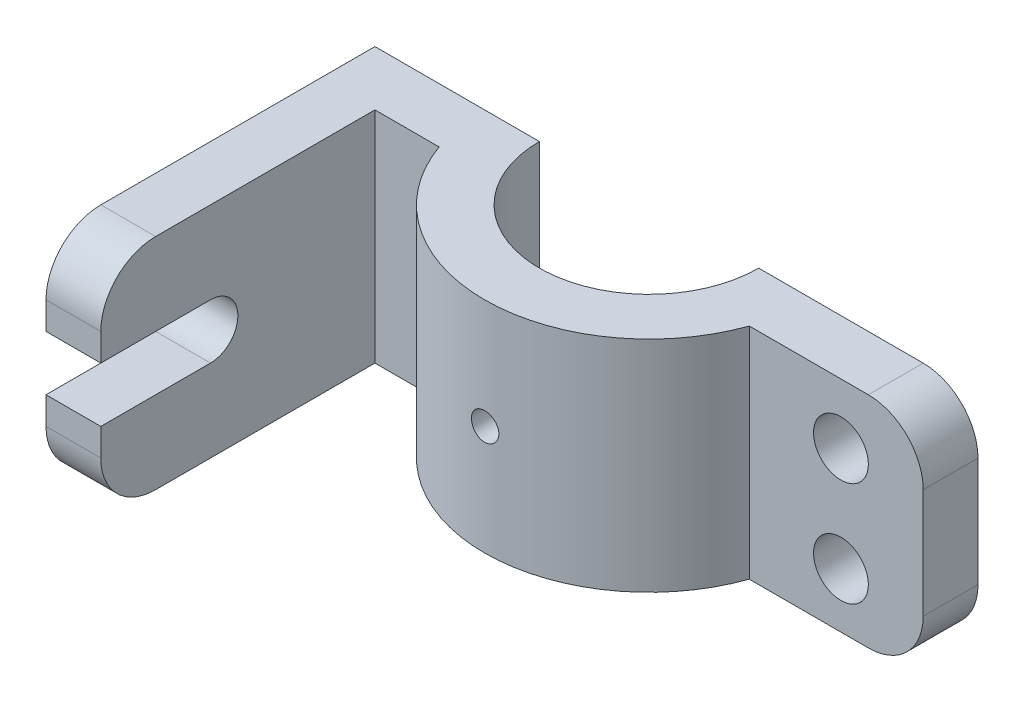
ISO-10303-21;
HEADER;
FILE_DESCRIPTION(('STEP AP214'),'2;1');
FILE_NAME('part.step','',(''),(''),'','','');
FILE_SCHEMA(('AUTOMOTIVE_DESIGN { 1 0 10303 214 1 1 1 1 }'));
ENDSEC;
DATA;
#1=APPLICATION_CONTEXT('core data for automotive mechanical design processes');
#2=APPLICATION_PROTOCOL_DEFINITION('international standard','automotive_design',2000,#1);
#3=PRODUCT_CONTEXT('',#1,'mechanical');
#4=PRODUCT('Part','Part','',(#3));
#5=PRODUCT_RELATED_PRODUCT_CATEGORY('part','',(#4));
#6=PRODUCT_DEFINITION_FORMATION('','',#4);
#7=PRODUCT_DEFINITION_CONTEXT('part definition',#1,'design');
#8=PRODUCT_DEFINITION('design','',#6,#7);
#9=PRODUCT_DEFINITION_SHAPE('','',#8);
#10=(LENGTH_UNIT() NAMED_UNIT(*) SI_UNIT(.MILLI.,.METRE.));
#11=(NAMED_UNIT(*) PLANE_ANGLE_UNIT() SI_UNIT($,.RADIAN.));
#12=(NAMED_UNIT(*) SI_UNIT($,.STERADIAN.) SOLID_ANGLE_UNIT());
#13=UNCERTAINTY_MEASURE_WITH_UNIT(LENGTH_MEASURE(1.E-05),#10,'distance_accuracy_value','');
#14=(GEOMETRIC_REPRESENTATION_CONTEXT(3) GLOBAL_UNCERTAINTY_ASSIGNED_CONTEXT((#13)) GLOBAL_UNIT_ASSIGNED_CONTEXT((#10,
#11,#12)) REPRESENTATION_CONTEXT('',''));
#15=CARTESIAN_POINT('',(0.,0.,0.));
#16=DIRECTION('',(0.,0.,1.));
#17=DIRECTION('',(1.,0.,0.));
#18=AXIS2_PLACEMENT_3D('',#15,#16,#17);
#19=CARTESIAN_POINT('',(-63.5,-25.4,76.2));
#20=DIRECTION('',(0.,0.,1.));
#21=DIRECTION('',(1.,0.,0.));
#22=AXIS2_PLACEMENT_3D('',#19,#20,#21);
#23=PLANE('',#22);
#24=DIRECTION('',(0.,1.,0.));
#25=VECTOR('',#24,1.);
#26=CARTESIAN_POINT('',(-50.8,-25.4,76.2));
#27=LINE('',#26,#25);
#28=CARTESIAN_POINT('',(-50.8,6.35,76.2));
#29=VERTEX_POINT('',#28);
#30=CARTESIAN_POINT('',(-50.8,12.7,76.2));
#31=VERTEX_POINT('',#30);
#32=EDGE_CURVE('E255',#29,#31,#27,.T.);
#33=ORIENTED_EDGE('',*,*,#32,.T.);
#34=DIRECTION('',(1.,0.,0.));
#35=VECTOR('',#34,1.);
#36=CARTESIAN_POINT('',(-63.5,12.7,76.2));
#37=LINE('',#36,#35);
#38=CARTESIAN_POINT('',(-63.5,12.7,76.2));
#39=VERTEX_POINT('',#38);
#40=EDGE_CURVE('E186',#39,#31,#37,.T.);
#41=ORIENTED_EDGE('',*,*,#40,.F.);
#42=DIRECTION('',(0.,1.,0.));
#43=VECTOR('',#42,1.);
#44=CARTESIAN_POINT('',(-63.5,-25.4,76.2));
#45=LINE('',#44,#43);
#46=CARTESIAN_POINT('',(-63.5,6.35,76.2));
#47=VERTEX_POINT('',#46);
#48=EDGE_CURVE('E195',#47,#39,#45,.T.);
#49=ORIENTED_EDGE('',*,*,#48,.F.);
#50=DIRECTION('',(1.,0.,0.));
#51=VECTOR('',#50,1.);
#52=CARTESIAN_POINT('',(-63.5,6.35,76.2));
#53=LINE('',#52,#51);
#54=EDGE_CURVE('E374',#47,#29,#53,.T.);
#55=ORIENTED_EDGE('',*,*,#54,.T.);
#56=EDGE_LOOP('',(#33,#41,#49,#55));
#57=FACE_BOUND('',#56,.T.);
#58=ADVANCED_FACE('F42',(#57),#23,.T.);
#59=CARTESIAN_POINT('',(0.,-25.4,0.));
#60=DIRECTION('',(0.,1.,0.));
#61=DIRECTION('',(0.,0.,1.));
#62=AXIS2_PLACEMENT_3D('',#59,#60,#61);
#63=CYLINDRICAL_SURFACE('',#62,38.1);
#64=DIRECTION('',(0.,1.,0.));
#65=VECTOR('',#64,1.);
#66=CARTESIAN_POINT('',(35.9210244842766,-25.4,12.7));
#67=LINE('',#66,#65);
#68=CARTESIAN_POINT('',(35.9210244842766,-25.4,12.7));
#69=VERTEX_POINT('',#68);
#70=CARTESIAN_POINT('',(35.9210244842766,25.4,12.7));
#71=VERTEX_POINT('',#70);
#72=EDGE_CURVE('E246',#69,#71,#67,.T.);
#73=ORIENTED_EDGE('',*,*,#72,.T.);
#74=CARTESIAN_POINT('',(0.,25.4,0.));
#75=DIRECTION('',(0.,1.,0.));
#76=DIRECTION('',(0.,0.,1.));
#77=AXIS2_PLACEMENT_3D('',#74,#75,#76);
#78=CIRCLE('',#77,38.1);
#79=CARTESIAN_POINT('',(-35.9210244842766,25.4,12.7));
#80=VERTEX_POINT('',#79);
#81=EDGE_CURVE('E301',#80,#71,#78,.T.);
#82=ORIENTED_EDGE('',*,*,#81,.F.);
#83=DIRECTION('',(0.,1.,0.));
#84=VECTOR('',#83,1.);
#85=CARTESIAN_POINT('',(-35.9210244842766,-25.4,12.7));
#86=LINE('',#85,#84);
#87=CARTESIAN_POINT('',(-35.9210244842766,-25.4,12.7));
#88=VERTEX_POINT('',#87);
#89=EDGE_CURVE('E247',#88,#80,#86,.T.);
#90=ORIENTED_EDGE('',*,*,#89,.F.);
#91=CARTESIAN_POINT('',(0.,-25.4,0.));
#92=DIRECTION('',(0.,1.,0.));
#93=DIRECTION('',(0.,0.,1.));
#94=AXIS2_PLACEMENT_3D('',#91,#92,#93);
#95=CIRCLE('',#94,38.1);
#96=EDGE_CURVE('E217',#88,#69,#95,.T.);
#97=ORIENTED_EDGE('',*,*,#96,.T.);
#98=EDGE_LOOP('',(#73,#82,#90,#97));
#99=FACE_BOUND('',#98,.T.);
#100=CARTESIAN_POINT('',(0.,3.175,38.1));
#101=CARTESIAN_POINT('',(0.178009835499824,3.17499222497656,38.0999982668156));
#102=CARTESIAN_POINT('',(0.356140852297216,3.15997917084993,38.0987391612528));
#103=CARTESIAN_POINT('',(0.707474361973737,3.10031018286013,38.0938373989219));
#104=CARTESIAN_POINT('',(0.880671039090106,3.05562066578194,38.0901920418313));
#105=CARTESIAN_POINT('',(1.21699662148278,2.93790003665526,38.0809297195638));
#106=CARTESIAN_POINT('',(1.38013116284815,2.86488496075133,38.0753138701269));
#107=CARTESIAN_POINT('',(1.69178996609604,2.69261452880642,38.0627403508946));
#108=CARTESIAN_POINT('',(1.84031734388611,2.59336478570891,38.0557829682081));
#109=CARTESIAN_POINT('',(2.11896324989075,2.37116916352596,38.0412872607681));
#110=CARTESIAN_POINT('',(2.24903941992131,2.2481702435042,38.0337476587488));
#111=CARTESIAN_POINT('',(2.48672709897856,1.98207980567646,38.0189479905006));
#112=CARTESIAN_POINT('',(2.59433762110453,1.83898740563917,38.0116879365635));
#113=CARTESIAN_POINT('',(2.78418265358898,1.53651547821058,37.9982556219944));
#114=CARTESIAN_POINT('',(2.86637994462115,1.3771125130962,37.9920849624679));
#115=CARTESIAN_POINT('',(3.00282747723196,1.04670766160975,37.9815447012327));
#116=CARTESIAN_POINT('',(3.05707821245192,0.875705980175053,37.9771750677113));
#117=CARTESIAN_POINT('',(3.13596981967396,0.527382130777261,37.9707423231057));
#118=CARTESIAN_POINT('',(3.16067968761253,0.350075690523488,37.968673838225));
#119=CARTESIAN_POINT('',(3.18000128544898,-0.00617919752653686,37.9670606012069));
#120=CARTESIAN_POINT('',(3.17461358021004,-0.185127614443684,37.9675158017056));
#121=CARTESIAN_POINT('',(3.13394999388214,-0.539113937995906,37.970893621232));
#122=CARTESIAN_POINT('',(3.09874909852083,-0.714160525817611,37.9738100497468));
#123=CARTESIAN_POINT('',(2.99957485359084,-1.05585217897263,37.9817720033273));
#124=CARTESIAN_POINT('',(2.93560122300979,-1.22249716223298,37.9868175491873));
#125=CARTESIAN_POINT('',(2.78061352738271,-1.54289412616296,37.9984763494426));
#126=CARTESIAN_POINT('',(2.68956581960409,-1.69662975884034,38.0050915522431));
#127=CARTESIAN_POINT('',(2.48303873442488,-1.98666525075288,38.0191424929282));
#128=CARTESIAN_POINT('',(2.36755886222657,-2.12296475678366,38.026578247429));
#129=CARTESIAN_POINT('',(2.1150249235687,-2.37469495621897,38.0414599980697));
#130=CARTESIAN_POINT('',(1.97790603081507,-2.49006062861037,38.0489059561083));
#131=CARTESIAN_POINT('',(1.68621251648031,-2.69614562175866,38.0629474918672));
#132=CARTESIAN_POINT('',(1.53163788323619,-2.78686492604804,38.0695430690193));
#133=CARTESIAN_POINT('',(1.20937843362543,-2.94107794647314,38.0811419544561));
#134=CARTESIAN_POINT('',(1.04169223274381,-3.00456878281814,38.0861450943038));
#135=CARTESIAN_POINT('',(0.697989044137172,-3.10247707053297,38.0939934528246));
#136=CARTESIAN_POINT('',(0.521972229386114,-3.13689512528046,38.0968387162821));
#137=CARTESIAN_POINT('',(0.167167878021496,-3.17559932583201,38.1000449879418));
#138=CARTESIAN_POINT('',(-0.0116097974407479,-3.1799752824894,38.1004134006211));
#139=CARTESIAN_POINT('',(-0.367356239197988,-3.15870634250827,38.0986442362237));
#140=CARTESIAN_POINT('',(-0.544325022350487,-3.13306172589646,38.0965066825224));
#141=CARTESIAN_POINT('',(-0.891174101013421,-3.05255403391295,38.0899707414619));
#142=CARTESIAN_POINT('',(-1.06106412481862,-2.99773258711805,38.0855755755031));
#143=CARTESIAN_POINT('',(-1.3892344741369,-2.86046993379206,38.0750181510671));
#144=CARTESIAN_POINT('',(-1.54751461604895,-2.77802829058427,38.0688558646519));
#145=CARTESIAN_POINT('',(-1.84838091810856,-2.58763976623807,38.0554365379978));
#146=CARTESIAN_POINT('',(-1.99092931290567,-2.47963338719642,38.0481769584449));
#147=CARTESIAN_POINT('',(-2.2559044761285,-2.24126724386472,38.0333871868104));
#148=CARTESIAN_POINT('',(-2.37833089488567,-2.11090709120358,38.0258569900289));
#149=CARTESIAN_POINT('',(-2.59989493181995,-1.83114412727027,38.0113527686023));
#150=CARTESIAN_POINT('',(-2.6989739430168,-1.68169481669825,38.0043801720066));
#151=CARTESIAN_POINT('',(-2.87062882451547,-1.36822731540865,37.9918008178822));
#152=CARTESIAN_POINT('',(-2.94320495943163,-1.20420927017094,37.9861940467169));
#153=CARTESIAN_POINT('',(-3.05969408837379,-0.866467690037917,37.9769891604538));
#154=CARTESIAN_POINT('',(-3.10364295910149,-0.692756600531998,37.9733885320091));
#155=CARTESIAN_POINT('',(-3.16174681946474,-0.340389527898701,37.9685951856845));
#156=CARTESIAN_POINT('',(-3.17590238125424,-0.161733639798535,37.9674024215637));
#157=CARTESIAN_POINT('',(-3.1740111871787,0.194869200116344,37.9675605249187));
#158=CARTESIAN_POINT('',(-3.15805651654321,0.372816650975691,37.9689036370049));
#159=CARTESIAN_POINT('',(-3.09658976596172,0.723495294023953,37.9739656788632));
#160=CARTESIAN_POINT('',(-3.05107764093522,0.896226478256692,37.9776846122588));
#161=CARTESIAN_POINT('',(-2.93181122430417,1.23157539837152,37.9870772239316));
#162=CARTESIAN_POINT('',(-2.85805859047074,1.39419372724606,37.9927507874665));
#163=CARTESIAN_POINT('',(-2.68441506215752,1.7047554188214,38.0054135710335));
#164=CARTESIAN_POINT('',(-2.58452457793872,1.85269901180731,38.0124027704148));
#165=CARTESIAN_POINT('',(-2.36109491623877,2.13018287136631,38.0269347314331));
#166=CARTESIAN_POINT('',(-2.23748756762913,2.25966816498708,38.0344790491824));
#167=CARTESIAN_POINT('',(-1.97025649125608,2.49610621302054,38.0492569915573));
#168=CARTESIAN_POINT('',(-1.82662792738547,2.60305350767485,38.0564905405632));
#169=CARTESIAN_POINT('',(-1.52315472936839,2.79152305682576,38.0698449562422));
#170=CARTESIAN_POINT('',(-1.36328040865896,2.87299761523384,38.0759637267336));
#171=CARTESIAN_POINT('',(-1.03217901258645,3.00784197468781,38.0863745673925));
#172=CARTESIAN_POINT('',(-0.860965243438341,3.06124408161473,38.0906687362221));
#173=CARTESIAN_POINT('',(-0.573951252706957,3.124827324444,38.0958441705498));
#174=CARTESIAN_POINT('',(-0.459996839842145,3.14361706974302,38.0973955118432));
#175=CARTESIAN_POINT('',(-0.230711919516192,3.16870591072512,38.0994739869116));
#176=CARTESIAN_POINT('',(-0.115381415709418,3.17500503957104,38.1000011234057));
#177=CARTESIAN_POINT('',(0.,3.175,38.1));
#178=B_SPLINE_CURVE_WITH_KNOTS('',3,(#100,#101,#102,#103,#104,#105,#106,#107,#108,#109,#110,
#111,#112,#113,#114,#115,#116,#117,#118,#119,#120,#121,#122,#123,#124,#125,#126,#127,#128,#129,
#130,#131,#132,#133,#134,#135,#136,#137,#138,#139,#140,#141,#142,#143,#144,#145,#146,#147,#148,
#149,#150,#151,#152,#153,#154,#155,#156,#157,#158,#159,#160,#161,#162,#163,#164,#165,#166,#167,
#168,#169,#170,#171,#172,#173,#174,#175,#176,#177),.UNSPECIFIED.,.T.,.F.,(4,2,2,2,2,2,2,2,2,2,2,
2,2,2,2,2,2,2,2,2,2,2,2,2,2,2,2,2,2,2,2,2,2,2,2,2,2,2,4),(0.,0.533608238090442,1.06782136256813,
1.60173248959743,2.13552947792978,2.6705327233948,3.20555946624733,3.74136611869715,
4.27716330646085,4.81170662090287,5.34623990321315,5.8794327137517,6.41263073189471,
6.94649410002755,7.48036828094231,8.015873317191,8.55137871123697,9.0869407284968,
9.62249163040798,10.1564408030026,10.6903849950515,11.2235694067274,11.7567622484736,
12.2912084304539,12.8256638987622,13.3614470035957,13.8972247588295,14.4323297598995,
14.9674244846606,15.5008853965202,16.0343471220068,16.5677775370839,17.1011995799129,
17.6361784901023,18.1712868486313,18.7073912447361,19.2428773317892,19.588749441824,
19.9346206335602),.UNSPECIFIED.);
#179=CARTESIAN_POINT('',(0.,3.175,38.1));
#180=VERTEX_POINT('',#179);
#181=EDGE_CURVE('E296',#180,#180,#178,.T.);
#182=ORIENTED_EDGE('',*,*,#181,.T.);
#183=EDGE_LOOP('',(#182));
#184=FACE_BOUND('',#183,.T.);
#185=ADVANCED_FACE('F44',(#99,#184),#63,.T.);
#186=CARTESIAN_POINT('',(0.,-25.4,0.));
#187=DIRECTION('',(0.,1.,0.));
#188=DIRECTION('',(0.,0.,1.));
#189=AXIS2_PLACEMENT_3D('',#186,#187,#188);
#190=CYLINDRICAL_SURFACE('',#189,25.4);
#191=DIRECTION('',(0.,1.,0.));
#192=VECTOR('',#191,1.);
#193=CARTESIAN_POINT('',(-25.4,-25.4,0.));
#194=LINE('',#193,#192);
#195=CARTESIAN_POINT('',(-25.4,-25.4,0.));
#196=VERTEX_POINT('',#195);
#197=CARTESIAN_POINT('',(-25.4,25.4,0.));
#198=VERTEX_POINT('',#197);
#199=EDGE_CURVE('E265',#196,#198,#194,.T.);
#200=ORIENTED_EDGE('',*,*,#199,.T.);
#201=CARTESIAN_POINT('',(0.,25.4,0.));
#202=DIRECTION('',(0.,-1.,0.));
#203=DIRECTION('',(0.,0.,1.));
#204=AXIS2_PLACEMENT_3D('',#201,#202,#203);
#205=CIRCLE('',#204,25.4);
#206=CARTESIAN_POINT('',(25.4,25.4,0.));
#207=VERTEX_POINT('',#206);
#208=EDGE_CURVE('E210',#207,#198,#205,.T.);
#209=ORIENTED_EDGE('',*,*,#208,.F.);
#210=DIRECTION('',(0.,1.,0.));
#211=VECTOR('',#210,1.);
#212=CARTESIAN_POINT('',(25.4,-25.4,0.));
#213=LINE('',#212,#211);
#214=CARTESIAN_POINT('',(25.4,-25.4,0.));
#215=VERTEX_POINT('',#214);
#216=EDGE_CURVE('E268',#215,#207,#213,.T.);
#217=ORIENTED_EDGE('',*,*,#216,.F.);
#218=CARTESIAN_POINT('',(0.,-25.4,0.));
#219=DIRECTION('',(0.,-1.,0.));
#220=DIRECTION('',(0.,0.,1.));
#221=AXIS2_PLACEMENT_3D('',#218,#219,#220);
#222=CIRCLE('',#221,25.4);
#223=EDGE_CURVE('E227',#215,#196,#222,.T.);
#224=ORIENTED_EDGE('',*,*,#223,.T.);
#225=EDGE_LOOP('',(#200,#209,#217,#224));
#226=FACE_BOUND('',#225,.T.);
#227=CARTESIAN_POINT('',(-3.175,0.,25.2007812378902));
#228=CARTESIAN_POINT('',(-3.17499244963839,-0.177592080426585,25.2007837886635));
#229=CARTESIAN_POINT('',(-3.16004943175108,-0.355295155461863,25.2026787664858));
#230=CARTESIAN_POINT('',(-3.10067504542017,-0.705755796294147,25.2100510638639));
#231=CARTESIAN_POINT('',(-3.05621286278532,-0.878507997237261,25.2155321267418));
#232=CARTESIAN_POINT('',(-2.93913139989122,-1.21394205027667,25.2294462873713));
#233=CARTESIAN_POINT('',(-2.86653123009437,-1.37663065048783,25.2378773811748));
#234=CARTESIAN_POINT('',(-2.6952755320049,-1.68748513381817,25.2567392185894));
#235=CARTESIAN_POINT('',(-2.59662445796582,-1.83565349371445,25.2671696202699));
#236=CARTESIAN_POINT('',(-2.37547588183597,-2.11412105384433,25.2889202024282));
#237=CARTESIAN_POINT('',(-2.2528616550809,-2.24432723894478,25.3002445696241));
#238=CARTESIAN_POINT('',(-1.98751858105242,-2.48237091655283,25.3224694575149));
#239=CARTESIAN_POINT('',(-1.84478873365369,-2.59020729620031,25.333369957101));
#240=CARTESIAN_POINT('',(-1.54268148495849,-2.78078384597303,25.3535617465851));
#241=CARTESIAN_POINT('',(-1.38325059336262,-2.86343984727655,25.362847595855));
#242=CARTESIAN_POINT('',(-1.05263533193101,-3.00077022392504,25.3787178093219));
#243=CARTESIAN_POINT('',(-0.881451398588347,-3.05544563779668,25.3853022737815));
#244=CARTESIAN_POINT('',(-0.533140523443912,-3.13498492678472,25.3949983425693));
#245=CARTESIAN_POINT('',(-0.356049401772488,-3.16000343172534,25.3981279544165));
#246=CARTESIAN_POINT('',(-0.00015646487191214,-3.17999793899641,25.400623185561));
#247=CARTESIAN_POINT('',(0.178645282783361,-3.17497512317973,25.3999889529314));
#248=CARTESIAN_POINT('',(0.531831891597678,-3.13515349249807,25.3950425266791));
#249=CARTESIAN_POINT('',(0.706235831320857,-3.10052097892865,25.3907508751877));
#250=CARTESIAN_POINT('',(1.04673674815983,-3.00272300567998,25.3789949104676));
#251=CARTESIAN_POINT('',(1.21283356728738,-2.93955700356813,25.3715305369244));
#252=CARTESIAN_POINT('',(1.53252019560707,-2.78630825416459,25.3542324741605));
#253=CARTESIAN_POINT('',(1.68607514935746,-2.69615353868267,25.3443924638091));
#254=CARTESIAN_POINT('',(1.97593896442923,-2.49153887998564,25.3234440071291));
#255=CARTESIAN_POINT('',(2.11224703434605,-2.37707782207491,25.3123355026377));
#256=CARTESIAN_POINT('',(2.36472479908164,-2.12616819038005,25.2900036175486));
#257=CARTESIAN_POINT('',(2.48075048679492,-1.98957468537574,25.27877997072));
#258=CARTESIAN_POINT('',(2.68825072029389,-1.69877542288628,25.2575577136454));
#259=CARTESIAN_POINT('',(2.77972518912257,-1.54456961019666,25.2475591072393));
#260=CARTESIAN_POINT('',(2.93553460845007,-1.22279474063584,25.2299190931815));
#261=CARTESIAN_POINT('',(2.99985802092516,-1.05522003845944,25.2222786880333));
#262=CARTESIAN_POINT('',(3.09941170117447,-0.711530894020923,25.2102396796986));
#263=CARTESIAN_POINT('',(3.13464337103552,-0.535416863747924,25.2058409202811));
#264=CARTESIAN_POINT('',(3.17482274852393,-0.180920158860297,25.2008117875574));
#265=CARTESIAN_POINT('',(3.17997311933782,-0.00256079867723037,25.2001561965182));
#266=CARTESIAN_POINT('',(3.16037843060281,0.352478250675078,25.2026209322195));
#267=CARTESIAN_POINT('',(3.13563400825946,0.529157975564733,25.2057411784784));
#268=CARTESIAN_POINT('',(3.05712277296311,0.875215119743889,25.2153830017466));
#269=CARTESIAN_POINT('',(3.0034540943575,1.04461515129182,25.2218930752222));
#270=CARTESIAN_POINT('',(2.86871882327748,1.37201167666351,25.2375716986293));
#271=CARTESIAN_POINT('',(2.78765126819816,1.53000776959591,25.2467403419627));
#272=CARTESIAN_POINT('',(2.59992116813675,1.8310283976425,25.2667634281861));
#273=CARTESIAN_POINT('',(2.49312572186292,1.97396946494932,25.2776265177609));
#274=CARTESIAN_POINT('',(2.25715924280857,2.23997082349749,25.299787342298));
#275=CARTESIAN_POINT('',(2.12798733968036,2.36303034107234,25.3110850941534));
#276=CARTESIAN_POINT('',(1.85004935495932,2.5864873179147,25.3329197263244));
#277=CARTESIAN_POINT('',(1.70117578498863,2.68675160742964,25.343451902689));
#278=CARTESIAN_POINT('',(1.38858317873587,2.86085053639492,25.3624983355014));
#279=CARTESIAN_POINT('',(1.22486444176777,2.93468570857084,25.371012632622));
#280=CARTESIAN_POINT('',(0.887671401107105,3.0536105893732,25.3850430912955));
#281=CARTESIAN_POINT('',(0.714224589469956,3.09877726196015,25.3905672742338));
#282=CARTESIAN_POINT('',(0.362135492743005,3.15933339331798,25.3980283844051));
#283=CARTESIAN_POINT('',(0.18349344230639,3.17472419486102,25.3999654734014));
#284=CARTESIAN_POINT('',(-0.172614822846606,3.17526660131104,25.4000333757734));
#285=CARTESIAN_POINT('',(-0.350080754897705,3.16062354992134,25.3981900362311));
#286=CARTESIAN_POINT('',(-0.700008431644831,3.10194882094282,25.3909555827063));
#287=CARTESIAN_POINT('',(-0.872470179821048,3.05791716379299,25.3855644711913));
#288=CARTESIAN_POINT('',(-1.20746703259386,2.94177959477597,25.371837562191));
#289=CARTESIAN_POINT('',(-1.37000559140252,2.8696835171963,25.363502796311));
#290=CARTESIAN_POINT('',(-1.68070953817305,2.69948493044811,25.3448114846066));
#291=CARTESIAN_POINT('',(-1.82887475523332,2.60138211210654,25.3344549147471));
#292=CARTESIAN_POINT('',(-2.10767519531193,2.38119511652391,25.3127915628292));
#293=CARTESIAN_POINT('',(-2.23818931054762,2.25895815222913,25.3014790041464));
#294=CARTESIAN_POINT('',(-2.47693322090251,1.99428996107917,25.2792250195678));
#295=CARTESIAN_POINT('',(-2.58515773010499,1.85185395757099,25.2682836822188));
#296=CARTESIAN_POINT('',(-2.77660765798963,1.55020019818751,25.247965904353));
#297=CARTESIAN_POINT('',(-2.85973492459721,1.39091976083565,25.2385956701102));
#298=CARTESIAN_POINT('',(-2.99794331617167,1.06063193949829,25.2225537968289));
#299=CARTESIAN_POINT('',(-3.0530549444544,0.88963754089874,25.2158792243995));
#300=CARTESIAN_POINT('',(-3.12047368822544,0.598131916447537,25.2076049927833));
#301=CARTESIAN_POINT('',(-3.14089164938411,0.479459351544522,25.2050588293182));
#302=CARTESIAN_POINT('',(-3.16815731099932,0.240541492544761,25.20164609433));
#303=CARTESIAN_POINT('',(-3.17500511441663,0.12029621038765,25.2007795100634));
#304=CARTESIAN_POINT('',(-3.175,0.,25.2007812378902));
#305=B_SPLINE_CURVE_WITH_KNOTS('',3,(#227,#228,#229,#230,#231,#232,#233,#234,#235,#236,#237,
#238,#239,#240,#241,#242,#243,#244,#245,#246,#247,#248,#249,#250,#251,#252,#253,#254,#255,#256,
#257,#258,#259,#260,#261,#262,#263,#264,#265,#266,#267,#268,#269,#270,#271,#272,#273,#274,#275,
#276,#277,#278,#279,#280,#281,#282,#283,#284,#285,#286,#287,#288,#289,#290,#291,#292,#293,#294,
#295,#296,#297,#298,#299,#300,#301,#302,#303,#304),.UNSPECIFIED.,.T.,.F.,(4,2,2,2,2,2,2,2,2,2,2,
2,2,2,2,2,2,2,2,2,2,2,2,2,2,2,2,2,2,2,2,2,2,2,2,2,2,2,4),(0.,0.532336778214408,1.06523012274416,
1.59776217480876,2.13020323200342,2.66530553490378,3.20043445186139,3.73733296408155,
4.27421154734648,4.80827838118715,5.34232420449102,5.87339014468023,6.40446618106236,
6.93697119607325,7.46950063718827,8.00566975672832,8.54184055689734,9.07823897761605,
9.61461154491424,10.1473662661654,10.680109631985,11.2110567789484,11.7420225816212,
12.2757923082409,12.8095828008647,13.3464158508634,13.8832380794334,14.4186129811994,
14.9539637391454,15.4856664668915,16.0173688248529,16.5488850320406,17.0804075582766,
17.6154096369443,18.1505384441165,18.6877337408907,19.2243428820214,19.5849365683882,
19.9455275188143),.UNSPECIFIED.);
#306=CARTESIAN_POINT('',(-3.175,0.,25.2007812378902));
#307=VERTEX_POINT('',#306);
#308=EDGE_CURVE('E47',#307,#307,#305,.T.);
#309=ORIENTED_EDGE('',*,*,#308,.T.);
#310=EDGE_LOOP('',(#309));
#311=FACE_BOUND('',#310,.T.);
#312=ADVANCED_FACE('F349',(#226,#311),#190,.F.);
#313=CARTESIAN_POINT('',(25.4,-25.4,0.));
#314=DIRECTION('',(0.,0.,-1.));
#315=DIRECTION('',(-1.,0.,0.));
#316=AXIS2_PLACEMENT_3D('',#313,#314,#315);
#317=PLANE('',#316);
#318=CARTESIAN_POINT('',(57.15,-12.7,0.));
#319=DIRECTION('',(0.,0.,1.));
#320=DIRECTION('',(1.,0.,0.));
#321=AXIS2_PLACEMENT_3D('',#318,#319,#320);
#322=CIRCLE('',#321,6.35000000000001);
#323=CARTESIAN_POINT('',(63.5,-12.7,0.));
#324=VERTEX_POINT('',#323);
#325=EDGE_CURVE('E439',#324,#324,#322,.T.);
#326=ORIENTED_EDGE('',*,*,#325,.T.);
#327=EDGE_LOOP('',(#326));
#328=FACE_BOUND('',#327,.T.);
#329=CARTESIAN_POINT('',(63.5,-12.7,0.));
#330=DIRECTION('',(0.,0.,1.));
#331=DIRECTION('',(1.,0.,0.));
#332=AXIS2_PLACEMENT_3D('',#329,#330,#331);
#333=CIRCLE('',#332,12.7);
#334=CARTESIAN_POINT('',(63.5,-25.4,0.));
#335=VERTEX_POINT('',#334);
#336=CARTESIAN_POINT('',(76.2,-12.7,0.));
#337=VERTEX_POINT('',#336);
#338=EDGE_CURVE('E418',#335,#337,#333,.T.);
#339=ORIENTED_EDGE('',*,*,#338,.F.);
#340=DIRECTION('',(-1.,0.,0.));
#341=VECTOR('',#340,1.);
#342=CARTESIAN_POINT('',(25.4,-25.4,0.));
#343=LINE('',#342,#341);
#344=EDGE_CURVE('E224',#335,#215,#343,.T.);
#345=ORIENTED_EDGE('',*,*,#344,.T.);
#346=ORIENTED_EDGE('',*,*,#216,.T.);
#347=DIRECTION('',(-1.,0.,0.));
#348=VECTOR('',#347,1.);
#349=CARTESIAN_POINT('',(25.4,25.4,0.));
#350=LINE('',#349,#348);
#351=CARTESIAN_POINT('',(63.5,25.4,0.));
#352=VERTEX_POINT('',#351);
#353=EDGE_CURVE('E480',#352,#207,#350,.T.);
#354=ORIENTED_EDGE('',*,*,#353,.F.);
#355=CARTESIAN_POINT('',(63.5,12.7,0.));
#356=DIRECTION('',(0.,0.,1.));
#357=DIRECTION('',(1.,0.,0.));
#358=AXIS2_PLACEMENT_3D('',#355,#356,#357);
#359=CIRCLE('',#358,12.7);
#360=CARTESIAN_POINT('',(76.2,12.7,0.));
#361=VERTEX_POINT('',#360);
#362=EDGE_CURVE('E429',#361,#352,#359,.T.);
#363=ORIENTED_EDGE('',*,*,#362,.F.);
#364=DIRECTION('',(0.,1.,0.));
#365=VECTOR('',#364,1.);
#366=CARTESIAN_POINT('',(76.2,-25.4,0.));
#367=LINE('',#366,#365);
#368=EDGE_CURVE('E272',#337,#361,#367,.T.);
#369=ORIENTED_EDGE('',*,*,#368,.F.);
#370=EDGE_LOOP('',(#339,#345,#346,#354,#363,#369));
#371=FACE_BOUND('',#370,.T.);
#372=CARTESIAN_POINT('',(57.15,11.4549719572919,0.));
#373=DIRECTION('',(0.,0.,1.));
#374=DIRECTION('',(1.,0.,0.));
#375=AXIS2_PLACEMENT_3D('',#372,#373,#374);
#376=CIRCLE('',#375,6.35000000000001);
#377=CARTESIAN_POINT('',(63.5,11.4549719572919,0.));
#378=VERTEX_POINT('',#377);
#379=EDGE_CURVE('E440',#378,#378,#376,.T.);
#380=ORIENTED_EDGE('',*,*,#379,.T.);
#381=EDGE_LOOP('',(#380));
#382=FACE_BOUND('',#381,.T.);
#383=ADVANCED_FACE('F353',(#328,#371,#382),#317,.T.);
#384=CARTESIAN_POINT('',(76.2,-25.4,0.));
#385=DIRECTION('',(1.,0.,0.));
#386=DIRECTION('',(0.,0.,-1.));
#387=AXIS2_PLACEMENT_3D('',#384,#385,#386);
#388=PLANE('',#387);
#389=DIRECTION('',(0.,0.,-1.));
#390=VECTOR('',#389,1.);
#391=CARTESIAN_POINT('',(76.2,-12.7,38.1));
#392=LINE('',#391,#390);
#393=CARTESIAN_POINT('',(76.2,-12.7,12.7));
#394=VERTEX_POINT('',#393);
#395=EDGE_CURVE('E435',#394,#337,#392,.T.);
#396=ORIENTED_EDGE('',*,*,#395,.T.);
#397=ORIENTED_EDGE('',*,*,#368,.T.);
#398=DIRECTION('',(0.,0.,-1.));
#399=VECTOR('',#398,1.);
#400=CARTESIAN_POINT('',(76.2,12.7,38.1));
#401=LINE('',#400,#399);
#402=CARTESIAN_POINT('',(76.2,12.7,12.7));
#403=VERTEX_POINT('',#402);
#404=EDGE_CURVE('E432',#403,#361,#401,.T.);
#405=ORIENTED_EDGE('',*,*,#404,.F.);
#406=DIRECTION('',(0.,1.,0.));
#407=VECTOR('',#406,1.);
#408=CARTESIAN_POINT('',(76.2,-25.4,12.7));
#409=LINE('',#408,#407);
#410=EDGE_CURVE('E276',#394,#403,#409,.T.);
#411=ORIENTED_EDGE('',*,*,#410,.F.);
#412=EDGE_LOOP('',(#396,#397,#405,#411));
#413=FACE_BOUND('',#412,.T.);
#414=ADVANCED_FACE('F357',(#413),#388,.T.);
#415=CARTESIAN_POINT('',(35.9210244842766,-25.4,12.7));
#416=DIRECTION('',(0.,0.,1.));
#417=DIRECTION('',(1.,0.,0.));
#418=AXIS2_PLACEMENT_3D('',#415,#416,#417);
#419=PLANE('',#418);
#420=CARTESIAN_POINT('',(57.15,-12.7,12.7));
#421=DIRECTION('',(0.,0.,1.));
#422=DIRECTION('',(1.,0.,0.));
#423=AXIS2_PLACEMENT_3D('',#420,#421,#422);
#424=CIRCLE('',#423,6.35000000000001);
#425=CARTESIAN_POINT('',(63.5,-12.7,12.7));
#426=VERTEX_POINT('',#425);
#427=EDGE_CURVE('E285',#426,#426,#424,.F.);
#428=ORIENTED_EDGE('',*,*,#427,.T.);
#429=EDGE_LOOP('',(#428));
#430=FACE_BOUND('',#429,.T.);
#431=CARTESIAN_POINT('',(63.5,-12.7,12.7));
#432=DIRECTION('',(0.,0.,1.));
#433=DIRECTION('',(1.,0.,0.));
#434=AXIS2_PLACEMENT_3D('',#431,#432,#433);
#435=CIRCLE('',#434,12.7);
#436=CARTESIAN_POINT('',(63.5,-25.4,12.7));
#437=VERTEX_POINT('',#436);
#438=EDGE_CURVE('E289',#394,#437,#435,.F.);
#439=ORIENTED_EDGE('',*,*,#438,.F.);
#440=ORIENTED_EDGE('',*,*,#410,.T.);
#441=CARTESIAN_POINT('',(63.5,12.7,12.7));
#442=DIRECTION('',(0.,0.,1.));
#443=DIRECTION('',(1.,0.,0.));
#444=AXIS2_PLACEMENT_3D('',#441,#442,#443);
#445=CIRCLE('',#444,12.7);
#446=CARTESIAN_POINT('',(63.5,25.4,12.7));
#447=VERTEX_POINT('',#446);
#448=EDGE_CURVE('E444',#447,#403,#445,.F.);
#449=ORIENTED_EDGE('',*,*,#448,.F.);
#450=DIRECTION('',(1.,0.,0.));
#451=VECTOR('',#450,1.);
#452=CARTESIAN_POINT('',(35.9210244842766,25.4,12.7));
#453=LINE('',#452,#451);
#454=EDGE_CURVE('E306',#71,#447,#453,.T.);
#455=ORIENTED_EDGE('',*,*,#454,.F.);
#456=ORIENTED_EDGE('',*,*,#72,.F.);
#457=DIRECTION('',(1.,0.,0.));
#458=VECTOR('',#457,1.);
#459=CARTESIAN_POINT('',(35.9210244842766,-25.4,12.7));
#460=LINE('',#459,#458);
#461=EDGE_CURVE('E220',#69,#437,#460,.T.);
#462=ORIENTED_EDGE('',*,*,#461,.T.);
#463=EDGE_LOOP('',(#439,#440,#449,#455,#456,#462));
#464=FACE_BOUND('',#463,.T.);
#465=CARTESIAN_POINT('',(57.15,11.4549719572919,12.7));
#466=DIRECTION('',(0.,0.,1.));
#467=DIRECTION('',(1.,0.,0.));
#468=AXIS2_PLACEMENT_3D('',#465,#466,#467);
#469=CIRCLE('',#468,6.35000000000001);
#470=CARTESIAN_POINT('',(63.5,11.4549719572919,12.7));
#471=VERTEX_POINT('',#470);
#472=EDGE_CURVE('E288',#471,#471,#469,.F.);
#473=ORIENTED_EDGE('',*,*,#472,.T.);
#474=EDGE_LOOP('',(#473));
#475=FACE_BOUND('',#474,.T.);
#476=ADVANCED_FACE('F336',(#430,#464,#475),#419,.T.);
#477=CARTESIAN_POINT('',(-50.8,-25.4,12.7));
#478=DIRECTION('',(0.,0.,1.));
#479=DIRECTION('',(1.,0.,0.));
#480=AXIS2_PLACEMENT_3D('',#477,#478,#479);
#481=PLANE('',#480);
#482=ORIENTED_EDGE('',*,*,#89,.T.);
#483=DIRECTION('',(1.,0.,0.));
#484=VECTOR('',#483,1.);
#485=CARTESIAN_POINT('',(-50.8,25.4,12.7));
#486=LINE('',#485,#484);
#487=CARTESIAN_POINT('',(-50.8,25.4,12.7));
#488=VERTEX_POINT('',#487);
#489=EDGE_CURVE('E208',#488,#80,#486,.T.);
#490=ORIENTED_EDGE('',*,*,#489,.F.);
#491=DIRECTION('',(0.,1.,0.));
#492=VECTOR('',#491,1.);
#493=CARTESIAN_POINT('',(-50.8,-25.4,12.7));
#494=LINE('',#493,#492);
#495=CARTESIAN_POINT('',(-50.8,-25.4,12.7));
#496=VERTEX_POINT('',#495);
#497=EDGE_CURVE('E250',#496,#488,#494,.T.);
#498=ORIENTED_EDGE('',*,*,#497,.F.);
#499=DIRECTION('',(1.,0.,0.));
#500=VECTOR('',#499,1.);
#501=CARTESIAN_POINT('',(-50.8,-25.4,12.7));
#502=LINE('',#501,#500);
#503=EDGE_CURVE('E242',#496,#88,#502,.T.);
#504=ORIENTED_EDGE('',*,*,#503,.T.);
#505=EDGE_LOOP('',(#482,#490,#498,#504));
#506=FACE_BOUND('',#505,.T.);
#507=ADVANCED_FACE('F332',(#506),#481,.T.);
#508=CARTESIAN_POINT('',(-50.8,-25.4,12.7));
#509=DIRECTION('',(1.,0.,0.));
#510=DIRECTION('',(0.,0.,-1.));
#511=AXIS2_PLACEMENT_3D('',#508,#509,#510);
#512=PLANE('',#511);
#513=CARTESIAN_POINT('',(-50.8,-12.7,63.5));
#514=DIRECTION('',(-1.,0.,0.));
#515=DIRECTION('',(0.,0.,-1.));
#516=AXIS2_PLACEMENT_3D('',#513,#514,#515);
#517=CIRCLE('',#516,12.7);
#518=CARTESIAN_POINT('',(-50.8,-25.4,63.5));
#519=VERTEX_POINT('',#518);
#520=CARTESIAN_POINT('',(-50.8,-12.7,76.2));
#521=VERTEX_POINT('',#520);
#522=EDGE_CURVE('E391',#519,#521,#517,.T.);
#523=ORIENTED_EDGE('',*,*,#522,.F.);
#524=DIRECTION('',(0.,0.,-1.));
#525=VECTOR('',#524,1.);
#526=CARTESIAN_POINT('',(-50.8,-25.4,12.7));
#527=LINE('',#526,#525);
#528=EDGE_CURVE('E239',#519,#496,#527,.T.);
#529=ORIENTED_EDGE('',*,*,#528,.T.);
#530=ORIENTED_EDGE('',*,*,#497,.T.);
#531=DIRECTION('',(0.,0.,-1.));
#532=VECTOR('',#531,1.);
#533=CARTESIAN_POINT('',(-50.8,25.4,12.7));
#534=LINE('',#533,#532);
#535=CARTESIAN_POINT('',(-50.8,25.4,63.5));
#536=VERTEX_POINT('',#535);
#537=EDGE_CURVE('E204',#536,#488,#534,.T.);
#538=ORIENTED_EDGE('',*,*,#537,.F.);
#539=CARTESIAN_POINT('',(-50.8,12.7,63.5));
#540=DIRECTION('',(-1.,0.,0.));
#541=DIRECTION('',(0.,0.,-1.));
#542=AXIS2_PLACEMENT_3D('',#539,#540,#541);
#543=CIRCLE('',#542,12.7);
#544=EDGE_CURVE('E181',#31,#536,#543,.T.);
#545=ORIENTED_EDGE('',*,*,#544,.F.);
#546=ORIENTED_EDGE('',*,*,#32,.F.);
#547=DIRECTION('',(0.,0.,1.));
#548=VECTOR('',#547,1.);
#549=CARTESIAN_POINT('',(-50.8,6.35,76.2));
#550=LINE('',#549,#548);
#551=CARTESIAN_POINT('',(-50.8,6.35,50.8));
#552=VERTEX_POINT('',#551);
#553=EDGE_CURVE('E378',#552,#29,#550,.T.);
#554=ORIENTED_EDGE('',*,*,#553,.F.);
#555=CARTESIAN_POINT('',(-50.8,0.,50.8));
#556=DIRECTION('',(1.,0.,0.));
#557=DIRECTION('',(0.,0.,-1.));
#558=AXIS2_PLACEMENT_3D('',#555,#556,#557);
#559=CIRCLE('',#558,6.35);
#560=CARTESIAN_POINT('',(-50.8,-6.35,50.8));
#561=VERTEX_POINT('',#560);
#562=EDGE_CURVE('E410',#561,#552,#559,.T.);
#563=ORIENTED_EDGE('',*,*,#562,.F.);
#564=DIRECTION('',(0.,0.,-1.));
#565=VECTOR('',#564,1.);
#566=CARTESIAN_POINT('',(-50.8,-6.35,76.2));
#567=LINE('',#566,#565);
#568=CARTESIAN_POINT('',(-50.8,-6.35,76.2));
#569=VERTEX_POINT('',#568);
#570=EDGE_CURVE('E387',#569,#561,#567,.T.);
#571=ORIENTED_EDGE('',*,*,#570,.F.);
#572=EDGE_CURVE('E254',#521,#569,#27,.T.);
#573=ORIENTED_EDGE('',*,*,#572,.F.);
#574=EDGE_LOOP('',(#523,#529,#530,#538,#545,#546,#554,#563,#571,#573));
#575=FACE_BOUND('',#574,.T.);
#576=ADVANCED_FACE('F335',(#575),#512,.T.);
#577=DIRECTION('',(1.,0.,0.));
#578=VECTOR('',#577,1.);
#579=CARTESIAN_POINT('',(-63.5,-12.7,76.2));
#580=LINE('',#579,#578);
#581=CARTESIAN_POINT('',(-63.5,-12.7,76.2));
#582=VERTEX_POINT('',#581);
#583=EDGE_CURVE('E383',#582,#521,#580,.T.);
#584=ORIENTED_EDGE('',*,*,#583,.T.);
#585=ORIENTED_EDGE('',*,*,#572,.T.);
#586=DIRECTION('',(1.,0.,0.));
#587=VECTOR('',#586,1.);
#588=CARTESIAN_POINT('',(-63.5,-6.35,76.2));
#589=LINE('',#588,#587);
#590=CARTESIAN_POINT('',(-63.5,-6.35,76.2));
#591=VERTEX_POINT('',#590);
#592=EDGE_CURVE('E406',#591,#569,#589,.T.);
#593=ORIENTED_EDGE('',*,*,#592,.F.);
#594=EDGE_CURVE('E259',#582,#591,#45,.T.);
#595=ORIENTED_EDGE('',*,*,#594,.F.);
#596=EDGE_LOOP('',(#584,#585,#593,#595));
#597=FACE_BOUND('',#596,.T.);
#598=ADVANCED_FACE('F340',(#597),#23,.T.);
#599=CARTESIAN_POINT('',(-63.5,-25.4,0.));
#600=DIRECTION('',(-1.,0.,0.));
#601=DIRECTION('',(0.,0.,1.));
#602=AXIS2_PLACEMENT_3D('',#599,#600,#601);
#603=PLANE('',#602);
#604=CARTESIAN_POINT('',(-63.5,-12.7,63.5));
#605=DIRECTION('',(-1.,0.,0.));
#606=DIRECTION('',(0.,0.,-1.));
#607=AXIS2_PLACEMENT_3D('',#604,#605,#606);
#608=CIRCLE('',#607,12.7);
#609=CARTESIAN_POINT('',(-63.5,-25.4,63.5));
#610=VERTEX_POINT('',#609);
#611=EDGE_CURVE('E74',#610,#582,#608,.T.);
#612=ORIENTED_EDGE('',*,*,#611,.T.);
#613=ORIENTED_EDGE('',*,*,#594,.T.);
#614=DIRECTION('',(0.,0.,-1.));
#615=VECTOR('',#614,1.);
#616=CARTESIAN_POINT('',(-63.5,-6.35,76.2));
#617=LINE('',#616,#615);
#618=CARTESIAN_POINT('',(-63.5,-6.35,50.8));
#619=VERTEX_POINT('',#618);
#620=EDGE_CURVE('E397',#591,#619,#617,.T.);
#621=ORIENTED_EDGE('',*,*,#620,.T.);
#622=CARTESIAN_POINT('',(-63.5,0.,50.8));
#623=DIRECTION('',(1.,0.,0.));
#624=DIRECTION('',(0.,0.,-1.));
#625=AXIS2_PLACEMENT_3D('',#622,#623,#624);
#626=CIRCLE('',#625,6.35);
#627=CARTESIAN_POINT('',(-63.5,6.35,50.8));
#628=VERTEX_POINT('',#627);
#629=EDGE_CURVE('E66',#619,#628,#626,.T.);
#630=ORIENTED_EDGE('',*,*,#629,.T.);
#631=DIRECTION('',(0.,0.,1.));
#632=VECTOR('',#631,1.);
#633=CARTESIAN_POINT('',(-63.5,6.35,76.2));
#634=LINE('',#633,#632);
#635=EDGE_CURVE('E403',#628,#47,#634,.T.);
#636=ORIENTED_EDGE('',*,*,#635,.T.);
#637=ORIENTED_EDGE('',*,*,#48,.T.);
#638=CARTESIAN_POINT('',(-63.5,12.7,63.5));
#639=DIRECTION('',(-1.,0.,0.));
#640=DIRECTION('',(0.,0.,-1.));
#641=AXIS2_PLACEMENT_3D('',#638,#639,#640);
#642=CIRCLE('',#641,12.7);
#643=CARTESIAN_POINT('',(-63.5,25.4,63.5));
#644=VERTEX_POINT('',#643);
#645=EDGE_CURVE('E178',#39,#644,#642,.T.);
#646=ORIENTED_EDGE('',*,*,#645,.T.);
#647=DIRECTION('',(0.,0.,1.));
#648=VECTOR('',#647,1.);
#649=CARTESIAN_POINT('',(-63.5,25.4,0.));
#650=LINE('',#649,#648);
#651=CARTESIAN_POINT('',(-63.5,25.4,0.));
#652=VERTEX_POINT('',#651);
#653=EDGE_CURVE('E192',#652,#644,#650,.T.);
#654=ORIENTED_EDGE('',*,*,#653,.F.);
#655=DIRECTION('',(0.,1.,0.));
#656=VECTOR('',#655,1.);
#657=CARTESIAN_POINT('',(-63.5,-25.4,0.));
#658=LINE('',#657,#656);
#659=CARTESIAN_POINT('',(-63.5,-25.4,0.));
#660=VERTEX_POINT('',#659);
#661=EDGE_CURVE('E262',#660,#652,#658,.T.);
#662=ORIENTED_EDGE('',*,*,#661,.F.);
#663=DIRECTION('',(0.,0.,1.));
#664=VECTOR('',#663,1.);
#665=CARTESIAN_POINT('',(-63.5,-25.4,0.));
#666=LINE('',#665,#664);
#667=EDGE_CURVE('E235',#660,#610,#666,.T.);
#668=ORIENTED_EDGE('',*,*,#667,.T.);
#669=EDGE_LOOP('',(#612,#613,#621,#630,#636,#637,#646,#654,#662,#668));
#670=FACE_BOUND('',#669,.T.);
#671=ADVANCED_FACE('F191',(#670),#603,.T.);
#672=CARTESIAN_POINT('',(-63.5,-25.4,0.));
#673=DIRECTION('',(0.,0.,-1.));
#674=DIRECTION('',(-1.,0.,0.));
#675=AXIS2_PLACEMENT_3D('',#672,#673,#674);
#676=PLANE('',#675);
#677=ORIENTED_EDGE('',*,*,#661,.T.);
#678=DIRECTION('',(-1.,0.,0.));
#679=VECTOR('',#678,1.);
#680=CARTESIAN_POINT('',(-63.5,25.4,0.));
#681=LINE('',#680,#679);
#682=EDGE_CURVE('E202',#198,#652,#681,.T.);
#683=ORIENTED_EDGE('',*,*,#682,.F.);
#684=ORIENTED_EDGE('',*,*,#199,.F.);
#685=DIRECTION('',(-1.,0.,0.));
#686=VECTOR('',#685,1.);
#687=CARTESIAN_POINT('',(-63.5,-25.4,0.));
#688=LINE('',#687,#686);
#689=EDGE_CURVE('E231',#196,#660,#688,.T.);
#690=ORIENTED_EDGE('',*,*,#689,.T.);
#691=EDGE_LOOP('',(#677,#683,#684,#690));
#692=FACE_BOUND('',#691,.T.);
#693=ADVANCED_FACE('F330',(#692),#676,.T.);
#694=CARTESIAN_POINT('',(0.,-25.4,0.));
#695=DIRECTION('',(0.,1.,0.));
#696=DIRECTION('',(0.,0.,1.));
#697=AXIS2_PLACEMENT_3D('',#694,#695,#696);
#698=PLANE('',#697);
#699=ORIENTED_EDGE('',*,*,#528,.F.);
#700=DIRECTION('',(1.,0.,0.));
#701=VECTOR('',#700,1.);
#702=CARTESIAN_POINT('',(-63.5,-25.4,63.5));
#703=LINE('',#702,#701);
#704=EDGE_CURVE('E380',#610,#519,#703,.T.);
#705=ORIENTED_EDGE('',*,*,#704,.F.);
#706=ORIENTED_EDGE('',*,*,#667,.F.);
#707=ORIENTED_EDGE('',*,*,#689,.F.);
#708=ORIENTED_EDGE('',*,*,#223,.F.);
#709=ORIENTED_EDGE('',*,*,#344,.F.);
#710=DIRECTION('',(0.,0.,-1.));
#711=VECTOR('',#710,1.);
#712=CARTESIAN_POINT('',(63.5,-25.4,38.1));
#713=LINE('',#712,#711);
#714=EDGE_CURVE('E12',#335,#437,#713,.F.);
#715=ORIENTED_EDGE('',*,*,#714,.T.);
#716=ORIENTED_EDGE('',*,*,#461,.F.);
#717=ORIENTED_EDGE('',*,*,#96,.F.);
#718=ORIENTED_EDGE('',*,*,#503,.F.);
#719=EDGE_LOOP('',(#699,#705,#706,#707,#708,#709,#715,#716,#717,#718));
#720=FACE_BOUND('',#719,.T.);
#721=ADVANCED_FACE('F327',(#720),#698,.F.);
#722=CARTESIAN_POINT('',(0.,25.4,0.));
#723=DIRECTION('',(0.,1.,0.));
#724=DIRECTION('',(0.,0.,1.));
#725=AXIS2_PLACEMENT_3D('',#722,#723,#724);
#726=PLANE('',#725);
#727=DIRECTION('',(1.,0.,0.));
#728=VECTOR('',#727,1.);
#729=CARTESIAN_POINT('',(-63.5,25.4,63.5));
#730=LINE('',#729,#728);
#731=EDGE_CURVE('E175',#644,#536,#730,.T.);
#732=ORIENTED_EDGE('',*,*,#731,.T.);
#733=ORIENTED_EDGE('',*,*,#537,.T.);
#734=ORIENTED_EDGE('',*,*,#489,.T.);
#735=ORIENTED_EDGE('',*,*,#81,.T.);
#736=ORIENTED_EDGE('',*,*,#454,.T.);
#737=DIRECTION('',(0.,0.,-1.));
#738=VECTOR('',#737,1.);
#739=CARTESIAN_POINT('',(63.5,25.4,38.1));
#740=LINE('',#739,#738);
#741=EDGE_CURVE('E58',#352,#447,#740,.F.);
#742=ORIENTED_EDGE('',*,*,#741,.F.);
#743=ORIENTED_EDGE('',*,*,#353,.T.);
#744=ORIENTED_EDGE('',*,*,#208,.T.);
#745=ORIENTED_EDGE('',*,*,#682,.T.);
#746=ORIENTED_EDGE('',*,*,#653,.T.);
#747=EDGE_LOOP('',(#732,#733,#734,#735,#736,#742,#743,#744,#745,#746));
#748=FACE_BOUND('',#747,.T.);
#749=ADVANCED_FACE('F199',(#748),#726,.T.);
#750=CARTESIAN_POINT('',(63.5,12.7,38.1));
#751=DIRECTION('',(0.,0.,-1.));
#752=DIRECTION('',(-1.,0.,0.));
#753=AXIS2_PLACEMENT_3D('',#750,#751,#752);
#754=CYLINDRICAL_SURFACE('',#753,12.7);
#755=ORIENTED_EDGE('',*,*,#448,.T.);
#756=ORIENTED_EDGE('',*,*,#404,.T.);
#757=ORIENTED_EDGE('',*,*,#362,.T.);
#758=ORIENTED_EDGE('',*,*,#741,.T.);
#759=EDGE_LOOP('',(#755,#756,#757,#758));
#760=FACE_BOUND('',#759,.T.);
#761=ADVANCED_FACE('F326',(#760),#754,.T.);
#762=CARTESIAN_POINT('',(63.5,-12.7,38.1));
#763=DIRECTION('',(0.,0.,-1.));
#764=DIRECTION('',(-1.,0.,0.));
#765=AXIS2_PLACEMENT_3D('',#762,#763,#764);
#766=CYLINDRICAL_SURFACE('',#765,12.7);
#767=ORIENTED_EDGE('',*,*,#438,.T.);
#768=ORIENTED_EDGE('',*,*,#714,.F.);
#769=ORIENTED_EDGE('',*,*,#338,.T.);
#770=ORIENTED_EDGE('',*,*,#395,.F.);
#771=EDGE_LOOP('',(#767,#768,#769,#770));
#772=FACE_BOUND('',#771,.T.);
#773=ADVANCED_FACE('F454',(#772),#766,.T.);
#774=CARTESIAN_POINT('',(57.15,-12.7,38.1));
#775=DIRECTION('',(0.,0.,-1.));
#776=DIRECTION('',(-1.,0.,0.));
#777=AXIS2_PLACEMENT_3D('',#774,#775,#776);
#778=CYLINDRICAL_SURFACE('',#777,6.35000000000001);
#779=ORIENTED_EDGE('',*,*,#427,.F.);
#780=EDGE_LOOP('',(#779));
#781=FACE_BOUND('',#780,.T.);
#782=ORIENTED_EDGE('',*,*,#325,.F.);
#783=EDGE_LOOP('',(#782));
#784=FACE_BOUND('',#783,.T.);
#785=ADVANCED_FACE('F321',(#781,#784),#778,.F.);
#786=CARTESIAN_POINT('',(57.15,11.4549719572919,38.1));
#787=DIRECTION('',(0.,0.,-1.));
#788=DIRECTION('',(-1.,0.,0.));
#789=AXIS2_PLACEMENT_3D('',#786,#787,#788);
#790=CYLINDRICAL_SURFACE('',#789,6.35000000000001);
#791=ORIENTED_EDGE('',*,*,#472,.F.);
#792=EDGE_LOOP('',(#791));
#793=FACE_BOUND('',#792,.T.);
#794=ORIENTED_EDGE('',*,*,#379,.F.);
#795=EDGE_LOOP('',(#794));
#796=FACE_BOUND('',#795,.T.);
#797=ADVANCED_FACE('F319',(#793,#796),#790,.F.);
#798=CARTESIAN_POINT('',(0.,0.,38.1));
#799=DIRECTION('',(0.,0.,-1.));
#800=DIRECTION('',(-1.,0.,0.));
#801=AXIS2_PLACEMENT_3D('',#798,#799,#800);
#802=CYLINDRICAL_SURFACE('',#801,3.175);
#803=ORIENTED_EDGE('',*,*,#308,.F.);
#804=EDGE_LOOP('',(#803));
#805=FACE_BOUND('',#804,.T.);
#806=ORIENTED_EDGE('',*,*,#181,.F.);
#807=EDGE_LOOP('',(#806));
#808=FACE_BOUND('',#807,.T.);
#809=ADVANCED_FACE('F314',(#805,#808),#802,.F.);
#810=CARTESIAN_POINT('',(-63.5,12.7,63.5));
#811=DIRECTION('',(1.,0.,0.));
#812=DIRECTION('',(0.,0.,-1.));
#813=AXIS2_PLACEMENT_3D('',#810,#811,#812);
#814=CYLINDRICAL_SURFACE('',#813,12.7);
#815=ORIENTED_EDGE('',*,*,#544,.T.);
#816=ORIENTED_EDGE('',*,*,#731,.F.);
#817=ORIENTED_EDGE('',*,*,#645,.F.);
#818=ORIENTED_EDGE('',*,*,#40,.T.);
#819=EDGE_LOOP('',(#815,#816,#817,#818));
#820=FACE_BOUND('',#819,.T.);
#821=ADVANCED_FACE('F177',(#820),#814,.T.);
#822=CARTESIAN_POINT('',(-63.5,-12.7,63.5));
#823=DIRECTION('',(1.,0.,0.));
#824=DIRECTION('',(0.,0.,-1.));
#825=AXIS2_PLACEMENT_3D('',#822,#823,#824);
#826=CYLINDRICAL_SURFACE('',#825,12.7);
#827=ORIENTED_EDGE('',*,*,#522,.T.);
#828=ORIENTED_EDGE('',*,*,#583,.F.);
#829=ORIENTED_EDGE('',*,*,#611,.F.);
#830=ORIENTED_EDGE('',*,*,#704,.T.);
#831=EDGE_LOOP('',(#827,#828,#829,#830));
#832=FACE_BOUND('',#831,.T.);
#833=ADVANCED_FACE('F592',(#832),#826,.T.);
#834=CARTESIAN_POINT('',(-63.5,6.35,76.2));
#835=DIRECTION('',(0.,1.,0.));
#836=DIRECTION('',(0.,0.,1.));
#837=AXIS2_PLACEMENT_3D('',#834,#835,#836);
#838=PLANE('',#837);
#839=ORIENTED_EDGE('',*,*,#553,.T.);
#840=ORIENTED_EDGE('',*,*,#54,.F.);
#841=ORIENTED_EDGE('',*,*,#635,.F.);
#842=DIRECTION('',(1.,0.,0.));
#843=VECTOR('',#842,1.);
#844=CARTESIAN_POINT('',(-63.5,6.35,50.8));
#845=LINE('',#844,#843);
#846=EDGE_CURVE('E419',#628,#552,#845,.T.);
#847=ORIENTED_EDGE('',*,*,#846,.T.);
#848=EDGE_LOOP('',(#839,#840,#841,#847));
#849=FACE_BOUND('',#848,.T.);
#850=ADVANCED_FACE('F602',(#849),#838,.F.);
#851=CARTESIAN_POINT('',(-63.5,0.,50.8));
#852=DIRECTION('',(1.,0.,0.));
#853=DIRECTION('',(0.,0.,-1.));
#854=AXIS2_PLACEMENT_3D('',#851,#852,#853);
#855=CYLINDRICAL_SURFACE('',#854,6.35);
#856=ORIENTED_EDGE('',*,*,#562,.T.);
#857=ORIENTED_EDGE('',*,*,#846,.F.);
#858=ORIENTED_EDGE('',*,*,#629,.F.);
#859=DIRECTION('',(1.,0.,0.));
#860=VECTOR('',#859,1.);
#861=CARTESIAN_POINT('',(-63.5,-6.35,50.8));
#862=LINE('',#861,#860);
#863=EDGE_CURVE('E422',#619,#561,#862,.T.);
#864=ORIENTED_EDGE('',*,*,#863,.T.);
#865=EDGE_LOOP('',(#856,#857,#858,#864));
#866=FACE_BOUND('',#865,.T.);
#867=ADVANCED_FACE('F611',(#866),#855,.F.);
#868=CARTESIAN_POINT('',(-63.5,-6.35,76.2));
#869=DIRECTION('',(0.,-1.,0.));
#870=DIRECTION('',(0.,0.,-1.));
#871=AXIS2_PLACEMENT_3D('',#868,#869,#870);
#872=PLANE('',#871);
#873=ORIENTED_EDGE('',*,*,#570,.T.);
#874=ORIENTED_EDGE('',*,*,#863,.F.);
#875=ORIENTED_EDGE('',*,*,#620,.F.);
#876=ORIENTED_EDGE('',*,*,#592,.T.);
#877=EDGE_LOOP('',(#873,#874,#875,#876));
#878=FACE_BOUND('',#877,.T.);
#879=ADVANCED_FACE('F494',(#878),#872,.F.);
#880=CLOSED_SHELL('',(#58,#185,#312,#383,#414,#476,#507,#576,#598,#671,#693,#721,#749,#761,#773,
#785,#797,#809,#821,#833,#850,#867,#879));
#881=MANIFOLD_SOLID_BREP('B2',#880);
#882=ADVANCED_BREP_SHAPE_REPRESENTATION('',(#18,#881),#14);
#883=SHAPE_DEFINITION_REPRESENTATION(#9,#882);
ENDSEC;
END-ISO-10303-21;
